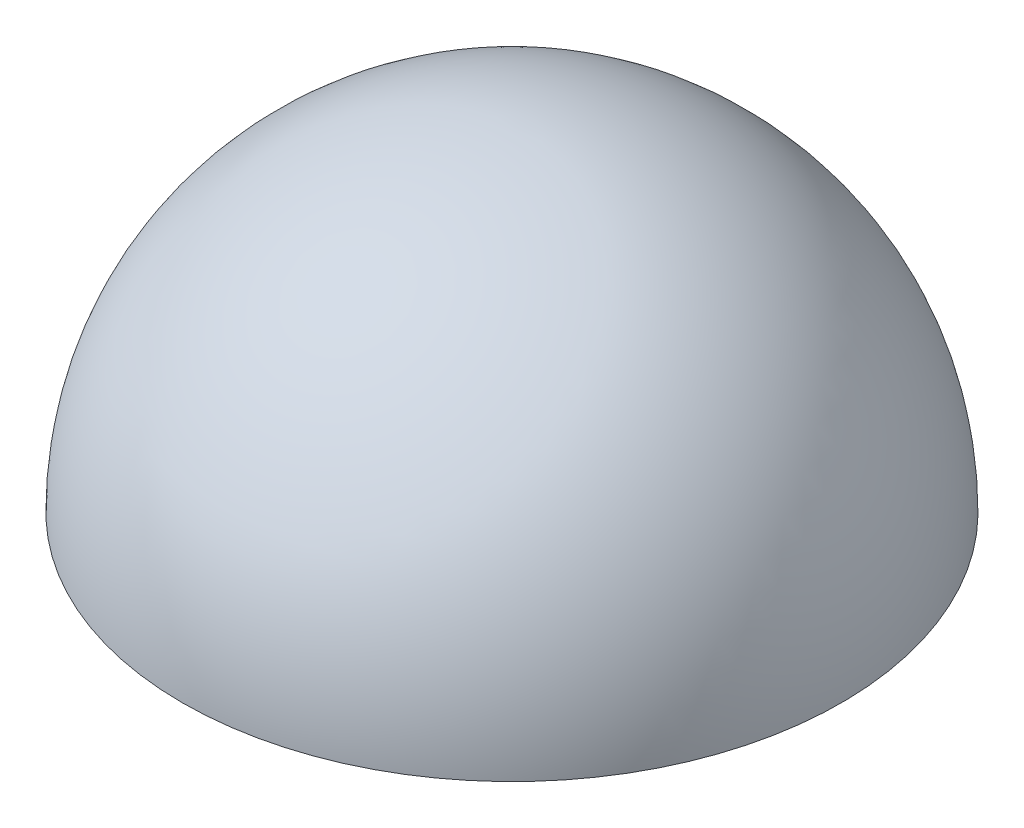
ISO-10303-21;
HEADER;
FILE_DESCRIPTION(('STEP AP214'),'2;1');
FILE_NAME('part.step','',(''),(''),'','','');
FILE_SCHEMA(('AUTOMOTIVE_DESIGN { 1 0 10303 214 1 1 1 1 }'));
ENDSEC;
DATA;
#1=APPLICATION_CONTEXT('core data for automotive mechanical design processes');
#2=APPLICATION_PROTOCOL_DEFINITION('international standard','automotive_design',2000,#1);
#3=PRODUCT_CONTEXT('',#1,'mechanical');
#4=PRODUCT('Part','Part','',(#3));
#5=PRODUCT_RELATED_PRODUCT_CATEGORY('part','',(#4));
#6=PRODUCT_DEFINITION_FORMATION('','',#4);
#7=PRODUCT_DEFINITION_CONTEXT('part definition',#1,'design');
#8=PRODUCT_DEFINITION('design','',#6,#7);
#9=PRODUCT_DEFINITION_SHAPE('','',#8);
#10=(LENGTH_UNIT() NAMED_UNIT(*) SI_UNIT(.MILLI.,.METRE.));
#11=(NAMED_UNIT(*) PLANE_ANGLE_UNIT() SI_UNIT($,.RADIAN.));
#12=(NAMED_UNIT(*) SI_UNIT($,.STERADIAN.) SOLID_ANGLE_UNIT());
#13=UNCERTAINTY_MEASURE_WITH_UNIT(LENGTH_MEASURE(1.E-05),#10,'distance_accuracy_value','');
#14=(GEOMETRIC_REPRESENTATION_CONTEXT(3) GLOBAL_UNCERTAINTY_ASSIGNED_CONTEXT((#13)) GLOBAL_UNIT_ASSIGNED_CONTEXT((#10,
#11,#12)) REPRESENTATION_CONTEXT('',''));
#15=CARTESIAN_POINT('',(0.,0.,0.));
#16=DIRECTION('',(0.,0.,1.));
#17=DIRECTION('',(1.,0.,0.));
#18=AXIS2_PLACEMENT_3D('',#15,#16,#17);
#19=CARTESIAN_POINT('',(0.,0.,0.));
#20=DIRECTION('',(0.,0.,1.));
#21=DIRECTION('',(1.,0.,0.));
#22=AXIS2_PLACEMENT_3D('',#19,#20,#21);
#23=SPHERICAL_SURFACE('',#22,4.);
#24=CARTESIAN_POINT('',(0.,0.,0.));
#25=DIRECTION('',(0.,-1.,0.));
#26=DIRECTION('',(0.,0.,1.));
#27=AXIS2_PLACEMENT_3D('',#24,#25,#26);
#28=SPHERICAL_SURFACE('',#27,4.);
#29=CARTESIAN_POINT('',(0.,0.,0.));
#30=DIRECTION('',(0.,-1.,0.));
#31=DIRECTION('',(0.,0.,1.));
#32=AXIS2_PLACEMENT_3D('',#29,#30,#31);
#33=CIRCLE('',#32,4.);
#34=CARTESIAN_POINT('',(0.,0.,4.));
#35=VERTEX_POINT('',#34);
#36=EDGE_CURVE('E10',#35,#35,#33,.T.);
#37=ORIENTED_EDGE('',*,*,#36,.F.);
#38=EDGE_LOOP('',(#37));
#39=FACE_BOUND('',#38,.T.);
#40=ADVANCED_FACE('F33',(#39),#28,.T.);
#41=CARTESIAN_POINT('',(0.,0.,0.));
#42=DIRECTION('',(0.,-1.,0.));
#43=DIRECTION('',(0.,0.,1.));
#44=AXIS2_PLACEMENT_3D('',#41,#42,#43);
#45=PLANE('',#44);
#46=ORIENTED_EDGE('',*,*,#36,.T.);
#47=EDGE_LOOP('',(#46));
#48=FACE_BOUND('',#47,.T.);
#49=ADVANCED_FACE('F40',(#48),#45,.T.);
#50=CLOSED_SHELL('',(#40,#49));
#51=MANIFOLD_SOLID_BREP('B2',#50);
#52=ADVANCED_BREP_SHAPE_REPRESENTATION('',(#18,#51),#14);
#53=SHAPE_DEFINITION_REPRESENTATION(#9,#52);
ENDSEC;
END-ISO-10303-21;
